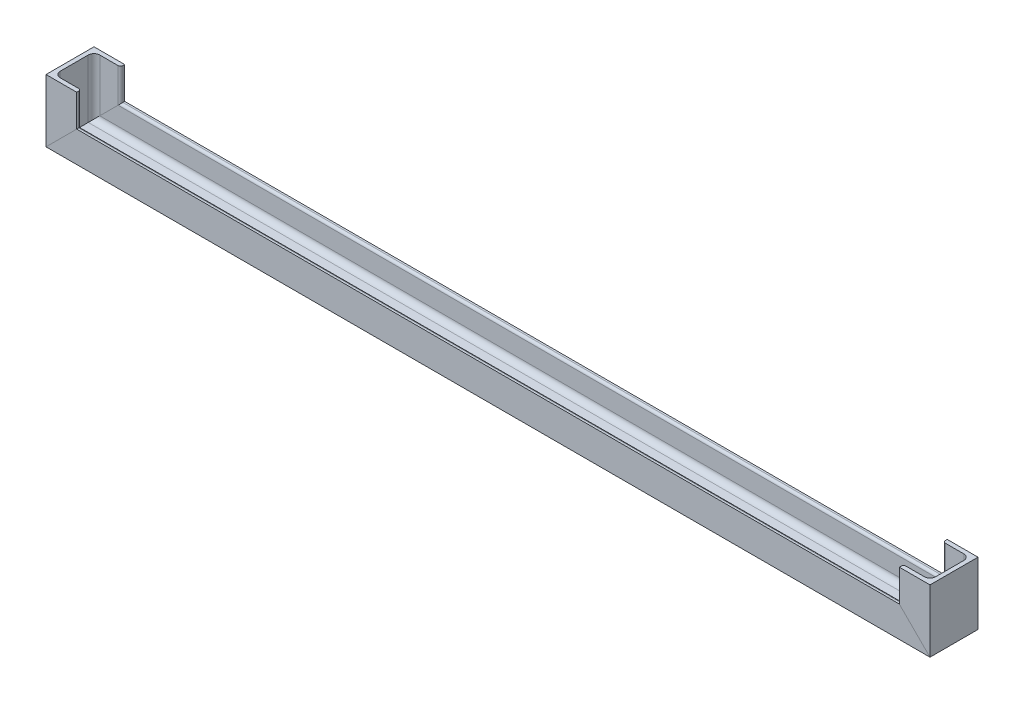
ISO-10303-21;
HEADER;
FILE_DESCRIPTION(('STEP AP214'),'2;1');
FILE_NAME('part.step','',(''),(''),'','','');
FILE_SCHEMA(('AUTOMOTIVE_DESIGN { 1 0 10303 214 1 1 1 1 }'));
ENDSEC;
DATA;
#1=APPLICATION_CONTEXT('core data for automotive mechanical design processes');
#2=APPLICATION_PROTOCOL_DEFINITION('international standard','automotive_design',2000,#1);
#3=PRODUCT_CONTEXT('',#1,'mechanical');
#4=PRODUCT('Part','Part','',(#3));
#5=PRODUCT_RELATED_PRODUCT_CATEGORY('part','',(#4));
#6=PRODUCT_DEFINITION_FORMATION('','',#4);
#7=PRODUCT_DEFINITION_CONTEXT('part definition',#1,'design');
#8=PRODUCT_DEFINITION('design','',#6,#7);
#9=PRODUCT_DEFINITION_SHAPE('','',#8);
#10=(LENGTH_UNIT() NAMED_UNIT(*) SI_UNIT(.MILLI.,.METRE.));
#11=(NAMED_UNIT(*) PLANE_ANGLE_UNIT() SI_UNIT($,.RADIAN.));
#12=(NAMED_UNIT(*) SI_UNIT($,.STERADIAN.) SOLID_ANGLE_UNIT());
#13=UNCERTAINTY_MEASURE_WITH_UNIT(LENGTH_MEASURE(1.E-05),#10,'distance_accuracy_value','');
#14=(GEOMETRIC_REPRESENTATION_CONTEXT(3) GLOBAL_UNCERTAINTY_ASSIGNED_CONTEXT((#13)) GLOBAL_UNIT_ASSIGNED_CONTEXT((#10,
#11,#12)) REPRESENTATION_CONTEXT('',''));
#15=CARTESIAN_POINT('',(0.,0.,0.));
#16=DIRECTION('',(0.,0.,1.));
#17=DIRECTION('',(1.,0.,0.));
#18=AXIS2_PLACEMENT_3D('',#15,#16,#17);
#19=CARTESIAN_POINT('',(-430.900000000001,69.2500000000001,23.1));
#20=DIRECTION('',(0.,1.,0.));
#21=DIRECTION('',(0.,0.,1.));
#22=AXIS2_PLACEMENT_3D('',#19,#20,#21);
#23=PLANE('',#22);
#24=DIRECTION('',(-1.,0.,0.));
#25=VECTOR('',#24,1.);
#26=CARTESIAN_POINT('',(-460.400000000001,69.2500000000001,25.));
#27=LINE('',#26,#25);
#28=CARTESIAN_POINT('',(-428.400000000001,69.2500000000001,25.));
#29=VERTEX_POINT('',#28);
#30=CARTESIAN_POINT('',(-460.400000000001,69.2500000000001,25.));
#31=VERTEX_POINT('',#30);
#32=EDGE_CURVE('E297',#29,#31,#27,.T.);
#33=ORIENTED_EDGE('',*,*,#32,.F.);
#34=DIRECTION('',(0.,0.,1.));
#35=VECTOR('',#34,1.);
#36=CARTESIAN_POINT('',(-428.400000000001,69.2500000000001,25.));
#37=LINE('',#36,#35);
#38=CARTESIAN_POINT('',(-428.400000000001,69.2500000000001,23.1));
#39=VERTEX_POINT('',#38);
#40=EDGE_CURVE('E304',#39,#29,#37,.T.);
#41=ORIENTED_EDGE('',*,*,#40,.F.);
#42=CARTESIAN_POINT('',(-430.900000000001,69.2500000000001,23.1));
#43=DIRECTION('',(0.,-1.,0.));
#44=DIRECTION('',(0.,0.,1.));
#45=AXIS2_PLACEMENT_3D('',#42,#43,#44);
#46=CIRCLE('',#45,2.5);
#47=CARTESIAN_POINT('',(-430.900000000001,69.2500000000001,20.6));
#48=VERTEX_POINT('',#47);
#49=EDGE_CURVE('E307',#48,#39,#46,.T.);
#50=ORIENTED_EDGE('',*,*,#49,.F.);
#51=DIRECTION('',(1.,0.,0.));
#52=VECTOR('',#51,1.);
#53=CARTESIAN_POINT('',(-430.900000000001,69.2500000000001,20.6));
#54=LINE('',#53,#52);
#55=CARTESIAN_POINT('',(-450.000000000001,69.2500000000001,20.6));
#56=VERTEX_POINT('',#55);
#57=EDGE_CURVE('E310',#56,#48,#54,.T.);
#58=ORIENTED_EDGE('',*,*,#57,.F.);
#59=CARTESIAN_POINT('',(-450.000000000001,69.2500000000001,14.6));
#60=DIRECTION('',(0.,1.,0.));
#61=DIRECTION('',(0.,0.,-1.));
#62=AXIS2_PLACEMENT_3D('',#59,#60,#61);
#63=CIRCLE('',#62,6.);
#64=CARTESIAN_POINT('',(-456.000000000001,69.2500000000001,14.6));
#65=VERTEX_POINT('',#64);
#66=EDGE_CURVE('E313',#65,#56,#63,.T.);
#67=ORIENTED_EDGE('',*,*,#66,.F.);
#68=DIRECTION('',(0.,0.,1.));
#69=VECTOR('',#68,1.);
#70=CARTESIAN_POINT('',(-456.000000000001,69.2500000000001,14.6));
#71=LINE('',#70,#69);
#72=CARTESIAN_POINT('',(-456.000000000001,69.2500000000001,-14.6));
#73=VERTEX_POINT('',#72);
#74=EDGE_CURVE('E316',#73,#65,#71,.T.);
#75=ORIENTED_EDGE('',*,*,#74,.F.);
#76=CARTESIAN_POINT('',(-450.000000000001,69.2500000000001,-14.6));
#77=DIRECTION('',(0.,1.,0.));
#78=DIRECTION('',(0.,0.,1.));
#79=AXIS2_PLACEMENT_3D('',#76,#77,#78);
#80=CIRCLE('',#79,6.);
#81=CARTESIAN_POINT('',(-450.000000000001,69.2500000000001,-20.6));
#82=VERTEX_POINT('',#81);
#83=EDGE_CURVE('E319',#82,#73,#80,.T.);
#84=ORIENTED_EDGE('',*,*,#83,.F.);
#85=DIRECTION('',(-1.,0.,0.));
#86=VECTOR('',#85,1.);
#87=CARTESIAN_POINT('',(-430.900000000001,69.2500000000001,-20.6));
#88=LINE('',#87,#86);
#89=CARTESIAN_POINT('',(-430.900000000001,69.2500000000001,-20.6));
#90=VERTEX_POINT('',#89);
#91=EDGE_CURVE('E322',#90,#82,#88,.T.);
#92=ORIENTED_EDGE('',*,*,#91,.F.);
#93=CARTESIAN_POINT('',(-430.900000000001,69.2500000000001,-23.1));
#94=DIRECTION('',(0.,-1.,0.));
#95=DIRECTION('',(0.,0.,-1.));
#96=AXIS2_PLACEMENT_3D('',#93,#94,#95);
#97=CIRCLE('',#96,2.5);
#98=CARTESIAN_POINT('',(-428.400000000001,69.2500000000001,-23.1));
#99=VERTEX_POINT('',#98);
#100=EDGE_CURVE('E325',#99,#90,#97,.T.);
#101=ORIENTED_EDGE('',*,*,#100,.F.);
#102=DIRECTION('',(0.,0.,1.));
#103=VECTOR('',#102,1.);
#104=CARTESIAN_POINT('',(-428.400000000001,69.2500000000001,-25.));
#105=LINE('',#104,#103);
#106=CARTESIAN_POINT('',(-428.400000000001,69.2500000000001,-25.));
#107=VERTEX_POINT('',#106);
#108=EDGE_CURVE('E44',#107,#99,#105,.T.);
#109=ORIENTED_EDGE('',*,*,#108,.F.);
#110=DIRECTION('',(1.,0.,0.));
#111=VECTOR('',#110,1.);
#112=CARTESIAN_POINT('',(-460.400000000001,69.2500000000001,-25.));
#113=LINE('',#112,#111);
#114=CARTESIAN_POINT('',(-460.400000000001,69.2500000000001,-25.));
#115=VERTEX_POINT('',#114);
#116=EDGE_CURVE('E11',#115,#107,#113,.T.);
#117=ORIENTED_EDGE('',*,*,#116,.F.);
#118=DIRECTION('',(0.,0.,-1.));
#119=VECTOR('',#118,1.);
#120=CARTESIAN_POINT('',(-460.400000000001,69.2500000000001,-25.));
#121=LINE('',#120,#119);
#122=EDGE_CURVE('E295',#31,#115,#121,.T.);
#123=ORIENTED_EDGE('',*,*,#122,.F.);
#124=EDGE_LOOP('',(#33,#41,#50,#58,#67,#75,#84,#92,#101,#109,#117,#123));
#125=FACE_BOUND('',#124,.T.);
#126=ADVANCED_FACE('F36',(#125),#23,.T.);
#127=CARTESIAN_POINT('',(-460.400000000001,3.99999999999989,-25.));
#128=DIRECTION('',(0.,0.,-1.));
#129=DIRECTION('',(-1.,0.,0.));
#130=AXIS2_PLACEMENT_3D('',#127,#128,#129);
#131=PLANE('',#130);
#132=DIRECTION('',(-0.707106781186548,-0.707106781186548,0.));
#133=VECTOR('',#132,1.);
#134=CARTESIAN_POINT('',(-427.775000000001,36.625,-25.));
#135=LINE('',#134,#133);
#136=CARTESIAN_POINT('',(-428.400000000001,35.9999999999999,-25.));
#137=VERTEX_POINT('',#136);
#138=CARTESIAN_POINT('',(-460.400000000001,3.99999999999995,-25.));
#139=VERTEX_POINT('',#138);
#140=EDGE_CURVE('E294',#137,#139,#135,.T.);
#141=ORIENTED_EDGE('',*,*,#140,.F.);
#142=DIRECTION('',(1.,0.,0.));
#143=VECTOR('',#142,1.);
#144=CARTESIAN_POINT('',(-460.400000000001,35.9999999999999,-25.));
#145=LINE('',#144,#143);
#146=CARTESIAN_POINT('',(428.400000000001,35.9999999999999,-25.));
#147=VERTEX_POINT('',#146);
#148=EDGE_CURVE('E39',#137,#147,#145,.T.);
#149=ORIENTED_EDGE('',*,*,#148,.T.);
#150=DIRECTION('',(0.707106781186547,-0.707106781186548,0.));
#151=VECTOR('',#150,1.);
#152=CARTESIAN_POINT('',(427.775000000001,36.6249999999999,-25.));
#153=LINE('',#152,#151);
#154=CARTESIAN_POINT('',(460.400000000001,3.99999999999988,-25.));
#155=VERTEX_POINT('',#154);
#156=EDGE_CURVE('E226',#147,#155,#153,.T.);
#157=ORIENTED_EDGE('',*,*,#156,.T.);
#158=DIRECTION('',(1.,0.,0.));
#159=VECTOR('',#158,1.);
#160=CARTESIAN_POINT('',(-460.400000000001,3.99999999999989,-25.));
#161=LINE('',#160,#159);
#162=EDGE_CURVE('E224',#139,#155,#161,.T.);
#163=ORIENTED_EDGE('',*,*,#162,.F.);
#164=EDGE_LOOP('',(#141,#149,#157,#163));
#165=FACE_BOUND('',#164,.T.);
#166=ADVANCED_FACE('F410',(#165),#131,.T.);
#167=CARTESIAN_POINT('',(-460.400000000001,35.9999999999999,-25.));
#168=DIRECTION('',(0.,1.,0.));
#169=DIRECTION('',(-1.,0.,0.));
#170=AXIS2_PLACEMENT_3D('',#167,#168,#169);
#171=PLANE('',#170);
#172=DIRECTION('',(0.,0.,-1.));
#173=VECTOR('',#172,1.);
#174=CARTESIAN_POINT('',(-428.400000000001,35.9999999999999,-25.));
#175=LINE('',#174,#173);
#176=CARTESIAN_POINT('',(-428.400000000001,35.9999999999999,-23.1));
#177=VERTEX_POINT('',#176);
#178=EDGE_CURVE('E357',#177,#137,#175,.T.);
#179=ORIENTED_EDGE('',*,*,#178,.F.);
#180=DIRECTION('',(1.,0.,0.));
#181=VECTOR('',#180,1.);
#182=CARTESIAN_POINT('',(-460.400000000001,35.9999999999999,-23.1));
#183=LINE('',#182,#181);
#184=CARTESIAN_POINT('',(428.400000000001,35.9999999999999,-23.1));
#185=VERTEX_POINT('',#184);
#186=EDGE_CURVE('E405',#177,#185,#183,.T.);
#187=ORIENTED_EDGE('',*,*,#186,.T.);
#188=DIRECTION('',(0.,0.,-1.));
#189=VECTOR('',#188,1.);
#190=CARTESIAN_POINT('',(428.400000000001,35.9999999999999,-25.));
#191=LINE('',#190,#189);
#192=EDGE_CURVE('E258',#185,#147,#191,.T.);
#193=ORIENTED_EDGE('',*,*,#192,.T.);
#194=ORIENTED_EDGE('',*,*,#148,.F.);
#195=EDGE_LOOP('',(#179,#187,#193,#194));
#196=FACE_BOUND('',#195,.T.);
#197=ADVANCED_FACE('F421',(#196),#171,.T.);
#198=CARTESIAN_POINT('',(-460.400000000001,33.4999999999999,-23.1));
#199=DIRECTION('',(1.,0.,0.));
#200=DIRECTION('',(0.,1.,0.));
#201=AXIS2_PLACEMENT_3D('',#198,#199,#200);
#202=CYLINDRICAL_SURFACE('',#201,2.5);
#203=CARTESIAN_POINT('',(-430.900000000001,33.4999999999999,-23.1));
#204=DIRECTION('',(0.707106781186547,-0.707106781186547,0.));
#205=DIRECTION('',(-0.707106781186548,-0.707106781186548,0.));
#206=AXIS2_PLACEMENT_3D('',#203,#204,#205);
#207=ELLIPSE('',#206,3.53553390593274,2.5);
#208=CARTESIAN_POINT('',(-430.900000000001,33.4999999999999,-20.6));
#209=VERTEX_POINT('',#208);
#210=EDGE_CURVE('E354',#209,#177,#207,.F.);
#211=ORIENTED_EDGE('',*,*,#210,.F.);
#212=DIRECTION('',(1.,0.,0.));
#213=VECTOR('',#212,1.);
#214=CARTESIAN_POINT('',(-460.400000000001,33.4999999999999,-20.6));
#215=LINE('',#214,#213);
#216=CARTESIAN_POINT('',(430.900000000001,33.4999999999998,-20.6));
#217=VERTEX_POINT('',#216);
#218=EDGE_CURVE('E404',#209,#217,#215,.T.);
#219=ORIENTED_EDGE('',*,*,#218,.T.);
#220=CARTESIAN_POINT('',(430.900000000001,33.4999999999999,-23.1));
#221=DIRECTION('',(0.707106781186548,0.707106781186547,0.));
#222=DIRECTION('',(0.707106781186547,-0.707106781186548,0.));
#223=AXIS2_PLACEMENT_3D('',#220,#221,#222);
#224=ELLIPSE('',#223,3.53553390593274,2.5);
#225=EDGE_CURVE('E255',#217,#185,#224,.F.);
#226=ORIENTED_EDGE('',*,*,#225,.T.);
#227=ORIENTED_EDGE('',*,*,#186,.F.);
#228=EDGE_LOOP('',(#211,#219,#226,#227));
#229=FACE_BOUND('',#228,.T.);
#230=ADVANCED_FACE('F506',(#229),#202,.T.);
#231=CARTESIAN_POINT('',(-460.400000000001,33.4999999999999,-20.6));
#232=DIRECTION('',(0.,0.,1.));
#233=DIRECTION('',(0.,-1.,0.));
#234=AXIS2_PLACEMENT_3D('',#231,#232,#233);
#235=PLANE('',#234);
#236=DIRECTION('',(0.707106781186548,0.707106781186548,0.));
#237=VECTOR('',#236,1.);
#238=CARTESIAN_POINT('',(-413.025000000001,51.375,-20.6));
#239=LINE('',#238,#237);
#240=CARTESIAN_POINT('',(-450.000000000001,14.4,-20.6));
#241=VERTEX_POINT('',#240);
#242=EDGE_CURVE('E351',#241,#209,#239,.T.);
#243=ORIENTED_EDGE('',*,*,#242,.F.);
#244=DIRECTION('',(1.,0.,0.));
#245=VECTOR('',#244,1.);
#246=CARTESIAN_POINT('',(-460.400000000001,14.4,-20.6));
#247=LINE('',#246,#245);
#248=CARTESIAN_POINT('',(450.000000000001,14.3999999999999,-20.6));
#249=VERTEX_POINT('',#248);
#250=EDGE_CURVE('E402',#241,#249,#247,.T.);
#251=ORIENTED_EDGE('',*,*,#250,.T.);
#252=DIRECTION('',(-0.707106781186547,0.707106781186548,0.));
#253=VECTOR('',#252,1.);
#254=CARTESIAN_POINT('',(413.025000000001,51.3749999999999,-20.6));
#255=LINE('',#254,#253);
#256=EDGE_CURVE('E252',#249,#217,#255,.T.);
#257=ORIENTED_EDGE('',*,*,#256,.T.);
#258=ORIENTED_EDGE('',*,*,#218,.F.);
#259=EDGE_LOOP('',(#243,#251,#257,#258));
#260=FACE_BOUND('',#259,.T.);
#261=ADVANCED_FACE('F501',(#260),#235,.T.);
#262=CARTESIAN_POINT('',(-460.400000000001,14.3999999999999,-14.6));
#263=DIRECTION('',(1.,0.,0.));
#264=DIRECTION('',(0.,1.,0.));
#265=AXIS2_PLACEMENT_3D('',#262,#263,#264);
#266=CYLINDRICAL_SURFACE('',#265,6.);
#267=CARTESIAN_POINT('',(-450.000000000001,14.3999999999999,-14.6));
#268=DIRECTION('',(0.707106781186547,-0.707106781186547,0.));
#269=DIRECTION('',(-0.707106781186548,-0.707106781186548,0.));
#270=AXIS2_PLACEMENT_3D('',#267,#268,#269);
#271=ELLIPSE('',#270,8.48528137423857,6.);
#272=CARTESIAN_POINT('',(-456.000000000001,8.3999999999999,-14.6));
#273=VERTEX_POINT('',#272);
#274=EDGE_CURVE('E348',#273,#241,#271,.T.);
#275=ORIENTED_EDGE('',*,*,#274,.F.);
#276=DIRECTION('',(1.,0.,0.));
#277=VECTOR('',#276,1.);
#278=CARTESIAN_POINT('',(-460.400000000001,8.39999999999991,-14.6));
#279=LINE('',#278,#277);
#280=CARTESIAN_POINT('',(456.000000000001,8.39999999999984,-14.6));
#281=VERTEX_POINT('',#280);
#282=EDGE_CURVE('E400',#273,#281,#279,.T.);
#283=ORIENTED_EDGE('',*,*,#282,.T.);
#284=CARTESIAN_POINT('',(450.000000000001,14.3999999999998,-14.6));
#285=DIRECTION('',(0.707106781186548,0.707106781186547,0.));
#286=DIRECTION('',(0.707106781186547,-0.707106781186548,0.));
#287=AXIS2_PLACEMENT_3D('',#284,#285,#286);
#288=ELLIPSE('',#287,8.48528137423857,6.);
#289=EDGE_CURVE('E249',#281,#249,#288,.T.);
#290=ORIENTED_EDGE('',*,*,#289,.T.);
#291=ORIENTED_EDGE('',*,*,#250,.F.);
#292=EDGE_LOOP('',(#275,#283,#290,#291));
#293=FACE_BOUND('',#292,.T.);
#294=ADVANCED_FACE('F494',(#293),#266,.F.);
#295=CARTESIAN_POINT('',(-460.400000000001,8.39999999999991,14.6));
#296=DIRECTION('',(0.,1.,0.));
#297=DIRECTION('',(-1.,0.,0.));
#298=AXIS2_PLACEMENT_3D('',#295,#296,#297);
#299=PLANE('',#298);
#300=DIRECTION('',(0.,0.,-1.));
#301=VECTOR('',#300,1.);
#302=CARTESIAN_POINT('',(-456.000000000001,8.39999999999991,14.6));
#303=LINE('',#302,#301);
#304=CARTESIAN_POINT('',(-456.000000000001,8.39999999999991,14.6));
#305=VERTEX_POINT('',#304);
#306=EDGE_CURVE('E345',#305,#273,#303,.T.);
#307=ORIENTED_EDGE('',*,*,#306,.F.);
#308=DIRECTION('',(1.,0.,0.));
#309=VECTOR('',#308,1.);
#310=CARTESIAN_POINT('',(-460.400000000001,8.39999999999991,14.6));
#311=LINE('',#310,#309);
#312=CARTESIAN_POINT('',(456.000000000001,8.39999999999985,14.6));
#313=VERTEX_POINT('',#312);
#314=EDGE_CURVE('E398',#305,#313,#311,.T.);
#315=ORIENTED_EDGE('',*,*,#314,.T.);
#316=DIRECTION('',(0.,0.,-1.));
#317=VECTOR('',#316,1.);
#318=CARTESIAN_POINT('',(456.000000000001,8.39999999999985,14.6));
#319=LINE('',#318,#317);
#320=EDGE_CURVE('E246',#313,#281,#319,.T.);
#321=ORIENTED_EDGE('',*,*,#320,.T.);
#322=ORIENTED_EDGE('',*,*,#282,.F.);
#323=EDGE_LOOP('',(#307,#315,#321,#322));
#324=FACE_BOUND('',#323,.T.);
#325=ADVANCED_FACE('F487',(#324),#299,.T.);
#326=CARTESIAN_POINT('',(-460.400000000001,14.3999999999999,14.6));
#327=DIRECTION('',(1.,0.,0.));
#328=DIRECTION('',(0.,1.,0.));
#329=AXIS2_PLACEMENT_3D('',#326,#327,#328);
#330=CYLINDRICAL_SURFACE('',#329,6.);
#331=CARTESIAN_POINT('',(-450.000000000001,14.3999999999999,14.6));
#332=DIRECTION('',(0.707106781186547,-0.707106781186547,0.));
#333=DIRECTION('',(-0.707106781186548,-0.707106781186548,0.));
#334=AXIS2_PLACEMENT_3D('',#331,#332,#333);
#335=ELLIPSE('',#334,8.48528137423857,6.);
#336=CARTESIAN_POINT('',(-450.000000000001,14.4,20.6));
#337=VERTEX_POINT('',#336);
#338=EDGE_CURVE('E342',#337,#305,#335,.T.);
#339=ORIENTED_EDGE('',*,*,#338,.F.);
#340=DIRECTION('',(1.,0.,0.));
#341=VECTOR('',#340,1.);
#342=CARTESIAN_POINT('',(-460.400000000001,14.4,20.6));
#343=LINE('',#342,#341);
#344=CARTESIAN_POINT('',(450.000000000001,14.3999999999999,20.6));
#345=VERTEX_POINT('',#344);
#346=EDGE_CURVE('E396',#337,#345,#343,.T.);
#347=ORIENTED_EDGE('',*,*,#346,.T.);
#348=CARTESIAN_POINT('',(450.000000000001,14.3999999999998,14.6));
#349=DIRECTION('',(0.707106781186548,0.707106781186547,0.));
#350=DIRECTION('',(0.707106781186547,-0.707106781186548,0.));
#351=AXIS2_PLACEMENT_3D('',#348,#349,#350);
#352=ELLIPSE('',#351,8.48528137423857,6.);
#353=EDGE_CURVE('E243',#345,#313,#352,.T.);
#354=ORIENTED_EDGE('',*,*,#353,.T.);
#355=ORIENTED_EDGE('',*,*,#314,.F.);
#356=EDGE_LOOP('',(#339,#347,#354,#355));
#357=FACE_BOUND('',#356,.T.);
#358=ADVANCED_FACE('F480',(#357),#330,.F.);
#359=CARTESIAN_POINT('',(-460.400000000001,33.4999999999999,20.6));
#360=DIRECTION('',(0.,0.,-1.));
#361=DIRECTION('',(0.,1.,0.));
#362=AXIS2_PLACEMENT_3D('',#359,#360,#361);
#363=PLANE('',#362);
#364=DIRECTION('',(-0.707106781186548,-0.707106781186548,0.));
#365=VECTOR('',#364,1.);
#366=CARTESIAN_POINT('',(-413.025000000001,51.375,20.6));
#367=LINE('',#366,#365);
#368=CARTESIAN_POINT('',(-430.900000000001,33.4999999999999,20.6));
#369=VERTEX_POINT('',#368);
#370=EDGE_CURVE('E339',#369,#337,#367,.T.);
#371=ORIENTED_EDGE('',*,*,#370,.F.);
#372=DIRECTION('',(1.,0.,0.));
#373=VECTOR('',#372,1.);
#374=CARTESIAN_POINT('',(-460.400000000001,33.4999999999999,20.6));
#375=LINE('',#374,#373);
#376=CARTESIAN_POINT('',(430.900000000001,33.4999999999998,20.6));
#377=VERTEX_POINT('',#376);
#378=EDGE_CURVE('E394',#369,#377,#375,.T.);
#379=ORIENTED_EDGE('',*,*,#378,.T.);
#380=DIRECTION('',(0.707106781186547,-0.707106781186548,0.));
#381=VECTOR('',#380,1.);
#382=CARTESIAN_POINT('',(413.025000000001,51.3749999999999,20.6));
#383=LINE('',#382,#381);
#384=EDGE_CURVE('E240',#377,#345,#383,.T.);
#385=ORIENTED_EDGE('',*,*,#384,.T.);
#386=ORIENTED_EDGE('',*,*,#346,.F.);
#387=EDGE_LOOP('',(#371,#379,#385,#386));
#388=FACE_BOUND('',#387,.T.);
#389=ADVANCED_FACE('F473',(#388),#363,.T.);
#390=CARTESIAN_POINT('',(-460.400000000001,33.4999999999999,23.1));
#391=DIRECTION('',(1.,0.,0.));
#392=DIRECTION('',(0.,1.,0.));
#393=AXIS2_PLACEMENT_3D('',#390,#391,#392);
#394=CYLINDRICAL_SURFACE('',#393,2.5);
#395=CARTESIAN_POINT('',(-430.900000000001,33.4999999999999,23.1));
#396=DIRECTION('',(0.707106781186547,-0.707106781186547,0.));
#397=DIRECTION('',(-0.707106781186548,-0.707106781186548,0.));
#398=AXIS2_PLACEMENT_3D('',#395,#396,#397);
#399=ELLIPSE('',#398,3.53553390593274,2.5);
#400=CARTESIAN_POINT('',(-428.400000000001,35.9999999999999,23.1));
#401=VERTEX_POINT('',#400);
#402=EDGE_CURVE('E336',#401,#369,#399,.F.);
#403=ORIENTED_EDGE('',*,*,#402,.F.);
#404=DIRECTION('',(1.,0.,0.));
#405=VECTOR('',#404,1.);
#406=CARTESIAN_POINT('',(-460.400000000001,35.9999999999999,23.1));
#407=LINE('',#406,#405);
#408=CARTESIAN_POINT('',(428.400000000001,35.9999999999999,23.1));
#409=VERTEX_POINT('',#408);
#410=EDGE_CURVE('E392',#401,#409,#407,.T.);
#411=ORIENTED_EDGE('',*,*,#410,.T.);
#412=CARTESIAN_POINT('',(430.900000000001,33.4999999999999,23.1));
#413=DIRECTION('',(0.707106781186548,0.707106781186547,0.));
#414=DIRECTION('',(0.707106781186547,-0.707106781186548,0.));
#415=AXIS2_PLACEMENT_3D('',#412,#413,#414);
#416=ELLIPSE('',#415,3.53553390593274,2.5);
#417=EDGE_CURVE('E233',#409,#377,#416,.F.);
#418=ORIENTED_EDGE('',*,*,#417,.T.);
#419=ORIENTED_EDGE('',*,*,#378,.F.);
#420=EDGE_LOOP('',(#403,#411,#418,#419));
#421=FACE_BOUND('',#420,.T.);
#422=ADVANCED_FACE('F466',(#421),#394,.T.);
#423=CARTESIAN_POINT('',(-460.400000000001,35.9999999999999,25.));
#424=DIRECTION('',(0.,1.,0.));
#425=DIRECTION('',(-1.,0.,0.));
#426=AXIS2_PLACEMENT_3D('',#423,#424,#425);
#427=PLANE('',#426);
#428=DIRECTION('',(0.,0.,-1.));
#429=VECTOR('',#428,1.);
#430=CARTESIAN_POINT('',(-428.400000000001,35.9999999999999,25.));
#431=LINE('',#430,#429);
#432=CARTESIAN_POINT('',(-428.400000000001,35.9999999999999,25.));
#433=VERTEX_POINT('',#432);
#434=EDGE_CURVE('E333',#433,#401,#431,.T.);
#435=ORIENTED_EDGE('',*,*,#434,.F.);
#436=DIRECTION('',(1.,0.,0.));
#437=VECTOR('',#436,1.);
#438=CARTESIAN_POINT('',(-460.400000000001,35.9999999999999,25.));
#439=LINE('',#438,#437);
#440=CARTESIAN_POINT('',(428.400000000001,35.9999999999999,25.));
#441=VERTEX_POINT('',#440);
#442=EDGE_CURVE('E205',#433,#441,#439,.T.);
#443=ORIENTED_EDGE('',*,*,#442,.T.);
#444=DIRECTION('',(0.,0.,-1.));
#445=VECTOR('',#444,1.);
#446=CARTESIAN_POINT('',(428.400000000001,35.9999999999999,25.));
#447=LINE('',#446,#445);
#448=EDGE_CURVE('E230',#441,#409,#447,.T.);
#449=ORIENTED_EDGE('',*,*,#448,.T.);
#450=ORIENTED_EDGE('',*,*,#410,.F.);
#451=EDGE_LOOP('',(#435,#443,#449,#450));
#452=FACE_BOUND('',#451,.T.);
#453=ADVANCED_FACE('F460',(#452),#427,.T.);
#454=CARTESIAN_POINT('',(-460.400000000001,3.99999999999989,25.));
#455=DIRECTION('',(0.,0.,1.));
#456=DIRECTION('',(1.,0.,0.));
#457=AXIS2_PLACEMENT_3D('',#454,#455,#456);
#458=PLANE('',#457);
#459=DIRECTION('',(0.707106781186548,0.707106781186548,0.));
#460=VECTOR('',#459,1.);
#461=CARTESIAN_POINT('',(-427.775000000001,36.625,25.));
#462=LINE('',#461,#460);
#463=CARTESIAN_POINT('',(-460.400000000001,3.99999999999995,25.));
#464=VERTEX_POINT('',#463);
#465=EDGE_CURVE('E201',#464,#433,#462,.T.);
#466=ORIENTED_EDGE('',*,*,#465,.F.);
#467=DIRECTION('',(1.,0.,0.));
#468=VECTOR('',#467,1.);
#469=CARTESIAN_POINT('',(-460.400000000001,3.99999999999989,25.));
#470=LINE('',#469,#468);
#471=CARTESIAN_POINT('',(460.400000000001,3.99999999999988,25.));
#472=VERTEX_POINT('',#471);
#473=EDGE_CURVE('E193',#464,#472,#470,.T.);
#474=ORIENTED_EDGE('',*,*,#473,.T.);
#475=DIRECTION('',(-0.707106781186547,0.707106781186548,0.));
#476=VECTOR('',#475,1.);
#477=CARTESIAN_POINT('',(427.775000000001,36.6249999999999,25.));
#478=LINE('',#477,#476);
#479=EDGE_CURVE('E198',#472,#441,#478,.T.);
#480=ORIENTED_EDGE('',*,*,#479,.T.);
#481=ORIENTED_EDGE('',*,*,#442,.F.);
#482=EDGE_LOOP('',(#466,#474,#480,#481));
#483=FACE_BOUND('',#482,.T.);
#484=ADVANCED_FACE('F195',(#483),#458,.T.);
#485=CARTESIAN_POINT('',(-460.400000000001,3.99999999999989,-25.));
#486=DIRECTION('',(0.,-1.,0.));
#487=DIRECTION('',(1.,0.,0.));
#488=AXIS2_PLACEMENT_3D('',#485,#486,#487);
#489=PLANE('',#488);
#490=ORIENTED_EDGE('',*,*,#162,.T.);
#491=DIRECTION('',(0.,0.,-1.));
#492=VECTOR('',#491,1.);
#493=CARTESIAN_POINT('',(460.400000000001,3.99999999999994,-25.));
#494=LINE('',#493,#492);
#495=EDGE_CURVE('E213',#472,#155,#494,.T.);
#496=ORIENTED_EDGE('',*,*,#495,.F.);
#497=ORIENTED_EDGE('',*,*,#473,.F.);
#498=DIRECTION('',(0.,0.,-1.));
#499=VECTOR('',#498,1.);
#500=CARTESIAN_POINT('',(-460.400000000001,4.,-25.));
#501=LINE('',#500,#499);
#502=EDGE_CURVE('E291',#464,#139,#501,.T.);
#503=ORIENTED_EDGE('',*,*,#502,.T.);
#504=EDGE_LOOP('',(#490,#496,#497,#503));
#505=FACE_BOUND('',#504,.T.);
#506=ADVANCED_FACE('F222',(#505),#489,.T.);
#507=CARTESIAN_POINT('',(-460.400000000001,69.2500000000001,-25.));
#508=DIRECTION('',(-1.,0.,0.));
#509=DIRECTION('',(0.,0.,1.));
#510=AXIS2_PLACEMENT_3D('',#507,#508,#509);
#511=PLANE('',#510);
#512=ORIENTED_EDGE('',*,*,#502,.F.);
#513=DIRECTION('',(0.,-1.,0.));
#514=VECTOR('',#513,1.);
#515=CARTESIAN_POINT('',(-460.400000000001,69.2500000000001,25.));
#516=LINE('',#515,#514);
#517=EDGE_CURVE('E293',#31,#464,#516,.T.);
#518=ORIENTED_EDGE('',*,*,#517,.F.);
#519=ORIENTED_EDGE('',*,*,#122,.T.);
#520=DIRECTION('',(0.,-1.,0.));
#521=VECTOR('',#520,1.);
#522=CARTESIAN_POINT('',(-460.400000000001,69.2500000000001,-25.));
#523=LINE('',#522,#521);
#524=EDGE_CURVE('E298',#115,#139,#523,.T.);
#525=ORIENTED_EDGE('',*,*,#524,.T.);
#526=EDGE_LOOP('',(#512,#518,#519,#525));
#527=FACE_BOUND('',#526,.T.);
#528=ADVANCED_FACE('F518',(#527),#511,.T.);
#529=CARTESIAN_POINT('',(-460.400000000001,69.2500000000001,-25.));
#530=DIRECTION('',(0.,0.,-1.));
#531=DIRECTION('',(-1.,0.,0.));
#532=AXIS2_PLACEMENT_3D('',#529,#530,#531);
#533=PLANE('',#532);
#534=DIRECTION('',(0.,-1.,0.));
#535=VECTOR('',#534,1.);
#536=CARTESIAN_POINT('',(-428.400000000001,69.2500000000001,-25.));
#537=LINE('',#536,#535);
#538=EDGE_CURVE('E330',#107,#137,#537,.T.);
#539=ORIENTED_EDGE('',*,*,#538,.T.);
#540=ORIENTED_EDGE('',*,*,#140,.T.);
#541=ORIENTED_EDGE('',*,*,#524,.F.);
#542=ORIENTED_EDGE('',*,*,#116,.T.);
#543=EDGE_LOOP('',(#539,#540,#541,#542));
#544=FACE_BOUND('',#543,.T.);
#545=ADVANCED_FACE('F515',(#544),#533,.T.);
#546=CARTESIAN_POINT('',(-428.400000000001,69.2500000000001,-25.));
#547=DIRECTION('',(1.,0.,0.));
#548=DIRECTION('',(0.,0.,-1.));
#549=AXIS2_PLACEMENT_3D('',#546,#547,#548);
#550=PLANE('',#549);
#551=DIRECTION('',(0.,-1.,0.));
#552=VECTOR('',#551,1.);
#553=CARTESIAN_POINT('',(-428.400000000001,69.2500000000001,-23.1));
#554=LINE('',#553,#552);
#555=EDGE_CURVE('E385',#99,#177,#554,.T.);
#556=ORIENTED_EDGE('',*,*,#555,.T.);
#557=ORIENTED_EDGE('',*,*,#178,.T.);
#558=ORIENTED_EDGE('',*,*,#538,.F.);
#559=ORIENTED_EDGE('',*,*,#108,.T.);
#560=EDGE_LOOP('',(#556,#557,#558,#559));
#561=FACE_BOUND('',#560,.T.);
#562=ADVANCED_FACE('F512',(#561),#550,.T.);
#563=CARTESIAN_POINT('',(-430.900000000001,69.2500000000001,-23.1));
#564=DIRECTION('',(0.,-1.,0.));
#565=DIRECTION('',(0.,0.,-1.));
#566=AXIS2_PLACEMENT_3D('',#563,#564,#565);
#567=CYLINDRICAL_SURFACE('',#566,2.5);
#568=DIRECTION('',(0.,-1.,0.));
#569=VECTOR('',#568,1.);
#570=CARTESIAN_POINT('',(-430.900000000001,69.2500000000001,-20.6));
#571=LINE('',#570,#569);
#572=EDGE_CURVE('E382',#90,#209,#571,.T.);
#573=ORIENTED_EDGE('',*,*,#572,.T.);
#574=ORIENTED_EDGE('',*,*,#210,.T.);
#575=ORIENTED_EDGE('',*,*,#555,.F.);
#576=ORIENTED_EDGE('',*,*,#100,.T.);
#577=EDGE_LOOP('',(#573,#574,#575,#576));
#578=FACE_BOUND('',#577,.T.);
#579=ADVANCED_FACE('F509',(#578),#567,.T.);
#580=CARTESIAN_POINT('',(-430.900000000001,69.2500000000001,-20.6));
#581=DIRECTION('',(0.,0.,1.));
#582=DIRECTION('',(1.,0.,0.));
#583=AXIS2_PLACEMENT_3D('',#580,#581,#582);
#584=PLANE('',#583);
#585=DIRECTION('',(0.,-1.,0.));
#586=VECTOR('',#585,1.);
#587=CARTESIAN_POINT('',(-450.000000000001,69.2500000000001,-20.6));
#588=LINE('',#587,#586);
#589=EDGE_CURVE('E379',#82,#241,#588,.T.);
#590=ORIENTED_EDGE('',*,*,#589,.T.);
#591=ORIENTED_EDGE('',*,*,#242,.T.);
#592=ORIENTED_EDGE('',*,*,#572,.F.);
#593=ORIENTED_EDGE('',*,*,#91,.T.);
#594=EDGE_LOOP('',(#590,#591,#592,#593));
#595=FACE_BOUND('',#594,.T.);
#596=ADVANCED_FACE('F542',(#595),#584,.T.);
#597=CARTESIAN_POINT('',(-450.000000000001,69.2500000000001,-14.6));
#598=DIRECTION('',(0.,-1.,0.));
#599=DIRECTION('',(0.,0.,-1.));
#600=AXIS2_PLACEMENT_3D('',#597,#598,#599);
#601=CYLINDRICAL_SURFACE('',#600,6.);
#602=DIRECTION('',(0.,-1.,0.));
#603=VECTOR('',#602,1.);
#604=CARTESIAN_POINT('',(-456.000000000001,69.2500000000001,-14.6));
#605=LINE('',#604,#603);
#606=EDGE_CURVE('E376',#73,#273,#605,.T.);
#607=ORIENTED_EDGE('',*,*,#606,.T.);
#608=ORIENTED_EDGE('',*,*,#274,.T.);
#609=ORIENTED_EDGE('',*,*,#589,.F.);
#610=ORIENTED_EDGE('',*,*,#83,.T.);
#611=EDGE_LOOP('',(#607,#608,#609,#610));
#612=FACE_BOUND('',#611,.T.);
#613=ADVANCED_FACE('F540',(#612),#601,.F.);
#614=CARTESIAN_POINT('',(-456.000000000001,69.2500000000001,14.6));
#615=DIRECTION('',(1.,0.,0.));
#616=DIRECTION('',(0.,0.,-1.));
#617=AXIS2_PLACEMENT_3D('',#614,#615,#616);
#618=PLANE('',#617);
#619=DIRECTION('',(0.,-1.,0.));
#620=VECTOR('',#619,1.);
#621=CARTESIAN_POINT('',(-456.000000000001,69.2500000000001,14.6));
#622=LINE('',#621,#620);
#623=EDGE_CURVE('E373',#65,#305,#622,.T.);
#624=ORIENTED_EDGE('',*,*,#623,.T.);
#625=ORIENTED_EDGE('',*,*,#306,.T.);
#626=ORIENTED_EDGE('',*,*,#606,.F.);
#627=ORIENTED_EDGE('',*,*,#74,.T.);
#628=EDGE_LOOP('',(#624,#625,#626,#627));
#629=FACE_BOUND('',#628,.T.);
#630=ADVANCED_FACE('F536',(#629),#618,.T.);
#631=CARTESIAN_POINT('',(-450.000000000001,69.2500000000001,14.6));
#632=DIRECTION('',(0.,-1.,0.));
#633=DIRECTION('',(0.,0.,-1.));
#634=AXIS2_PLACEMENT_3D('',#631,#632,#633);
#635=CYLINDRICAL_SURFACE('',#634,6.);
#636=DIRECTION('',(0.,-1.,0.));
#637=VECTOR('',#636,1.);
#638=CARTESIAN_POINT('',(-450.000000000001,69.2500000000001,20.6));
#639=LINE('',#638,#637);
#640=EDGE_CURVE('E370',#56,#337,#639,.T.);
#641=ORIENTED_EDGE('',*,*,#640,.T.);
#642=ORIENTED_EDGE('',*,*,#338,.T.);
#643=ORIENTED_EDGE('',*,*,#623,.F.);
#644=ORIENTED_EDGE('',*,*,#66,.T.);
#645=EDGE_LOOP('',(#641,#642,#643,#644));
#646=FACE_BOUND('',#645,.T.);
#647=ADVANCED_FACE('F534',(#646),#635,.F.);
#648=CARTESIAN_POINT('',(-430.900000000001,69.2500000000001,20.6));
#649=DIRECTION('',(0.,0.,-1.));
#650=DIRECTION('',(-1.,0.,0.));
#651=AXIS2_PLACEMENT_3D('',#648,#649,#650);
#652=PLANE('',#651);
#653=DIRECTION('',(0.,-1.,0.));
#654=VECTOR('',#653,1.);
#655=CARTESIAN_POINT('',(-430.900000000001,69.2500000000001,20.6));
#656=LINE('',#655,#654);
#657=EDGE_CURVE('E367',#48,#369,#656,.T.);
#658=ORIENTED_EDGE('',*,*,#657,.T.);
#659=ORIENTED_EDGE('',*,*,#370,.T.);
#660=ORIENTED_EDGE('',*,*,#640,.F.);
#661=ORIENTED_EDGE('',*,*,#57,.T.);
#662=EDGE_LOOP('',(#658,#659,#660,#661));
#663=FACE_BOUND('',#662,.T.);
#664=ADVANCED_FACE('F530',(#663),#652,.T.);
#665=CARTESIAN_POINT('',(-430.900000000001,69.2500000000001,23.1));
#666=DIRECTION('',(0.,-1.,0.));
#667=DIRECTION('',(0.,0.,-1.));
#668=AXIS2_PLACEMENT_3D('',#665,#666,#667);
#669=CYLINDRICAL_SURFACE('',#668,2.5);
#670=DIRECTION('',(0.,-1.,0.));
#671=VECTOR('',#670,1.);
#672=CARTESIAN_POINT('',(-428.400000000001,69.2500000000001,23.1));
#673=LINE('',#672,#671);
#674=EDGE_CURVE('E364',#39,#401,#673,.T.);
#675=ORIENTED_EDGE('',*,*,#674,.T.);
#676=ORIENTED_EDGE('',*,*,#402,.T.);
#677=ORIENTED_EDGE('',*,*,#657,.F.);
#678=ORIENTED_EDGE('',*,*,#49,.T.);
#679=EDGE_LOOP('',(#675,#676,#677,#678));
#680=FACE_BOUND('',#679,.T.);
#681=ADVANCED_FACE('F528',(#680),#669,.T.);
#682=CARTESIAN_POINT('',(-428.400000000001,69.2500000000001,25.));
#683=DIRECTION('',(1.,0.,0.));
#684=DIRECTION('',(0.,0.,-1.));
#685=AXIS2_PLACEMENT_3D('',#682,#683,#684);
#686=PLANE('',#685);
#687=DIRECTION('',(0.,-1.,0.));
#688=VECTOR('',#687,1.);
#689=CARTESIAN_POINT('',(-428.400000000001,69.2500000000001,25.));
#690=LINE('',#689,#688);
#691=EDGE_CURVE('E301',#29,#433,#690,.T.);
#692=ORIENTED_EDGE('',*,*,#691,.T.);
#693=ORIENTED_EDGE('',*,*,#434,.T.);
#694=ORIENTED_EDGE('',*,*,#674,.F.);
#695=ORIENTED_EDGE('',*,*,#40,.T.);
#696=EDGE_LOOP('',(#692,#693,#694,#695));
#697=FACE_BOUND('',#696,.T.);
#698=ADVANCED_FACE('F524',(#697),#686,.T.);
#699=CARTESIAN_POINT('',(-460.400000000001,69.2500000000001,25.));
#700=DIRECTION('',(0.,0.,1.));
#701=DIRECTION('',(1.,0.,0.));
#702=AXIS2_PLACEMENT_3D('',#699,#700,#701);
#703=PLANE('',#702);
#704=ORIENTED_EDGE('',*,*,#517,.T.);
#705=ORIENTED_EDGE('',*,*,#465,.T.);
#706=ORIENTED_EDGE('',*,*,#691,.F.);
#707=ORIENTED_EDGE('',*,*,#32,.T.);
#708=EDGE_LOOP('',(#704,#705,#706,#707));
#709=FACE_BOUND('',#708,.T.);
#710=ADVANCED_FACE('F522',(#709),#703,.T.);
#711=CARTESIAN_POINT('',(430.900000000001,69.25,23.1));
#712=DIRECTION('',(0.,1.,0.));
#713=DIRECTION('',(0.,0.,1.));
#714=AXIS2_PLACEMENT_3D('',#711,#712,#713);
#715=PLANE('',#714);
#716=DIRECTION('',(1.,0.,0.));
#717=VECTOR('',#716,1.);
#718=CARTESIAN_POINT('',(460.400000000001,69.25,25.));
#719=LINE('',#718,#717);
#720=CARTESIAN_POINT('',(428.400000000001,69.25,25.));
#721=VERTEX_POINT('',#720);
#722=CARTESIAN_POINT('',(460.400000000001,69.25,25.));
#723=VERTEX_POINT('',#722);
#724=EDGE_CURVE('E423',#721,#723,#719,.T.);
#725=ORIENTED_EDGE('',*,*,#724,.T.);
#726=DIRECTION('',(0.,0.,-1.));
#727=VECTOR('',#726,1.);
#728=CARTESIAN_POINT('',(460.400000000001,69.25,-25.));
#729=LINE('',#728,#727);
#730=CARTESIAN_POINT('',(460.400000000001,69.25,-25.));
#731=VERTEX_POINT('',#730);
#732=EDGE_CURVE('E216',#723,#731,#729,.T.);
#733=ORIENTED_EDGE('',*,*,#732,.T.);
#734=DIRECTION('',(-1.,0.,0.));
#735=VECTOR('',#734,1.);
#736=CARTESIAN_POINT('',(460.400000000001,69.25,-25.));
#737=LINE('',#736,#735);
#738=CARTESIAN_POINT('',(428.400000000001,69.25,-25.));
#739=VERTEX_POINT('',#738);
#740=EDGE_CURVE('E206',#731,#739,#737,.T.);
#741=ORIENTED_EDGE('',*,*,#740,.T.);
#742=DIRECTION('',(0.,0.,1.));
#743=VECTOR('',#742,1.);
#744=CARTESIAN_POINT('',(428.400000000001,69.25,-25.));
#745=LINE('',#744,#743);
#746=CARTESIAN_POINT('',(428.400000000001,69.25,-23.1));
#747=VERTEX_POINT('',#746);
#748=EDGE_CURVE('E417',#739,#747,#745,.T.);
#749=ORIENTED_EDGE('',*,*,#748,.T.);
#750=CARTESIAN_POINT('',(430.900000000001,69.25,-23.1));
#751=DIRECTION('',(0.,1.,0.));
#752=DIRECTION('',(0.,0.,-1.));
#753=AXIS2_PLACEMENT_3D('',#750,#751,#752);
#754=CIRCLE('',#753,2.5);
#755=CARTESIAN_POINT('',(430.900000000001,69.25,-20.6));
#756=VERTEX_POINT('',#755);
#757=EDGE_CURVE('E427',#747,#756,#754,.T.);
#758=ORIENTED_EDGE('',*,*,#757,.T.);
#759=DIRECTION('',(1.,0.,0.));
#760=VECTOR('',#759,1.);
#761=CARTESIAN_POINT('',(430.900000000001,69.25,-20.6));
#762=LINE('',#761,#760);
#763=CARTESIAN_POINT('',(450.000000000001,69.25,-20.6));
#764=VERTEX_POINT('',#763);
#765=EDGE_CURVE('E430',#756,#764,#762,.T.);
#766=ORIENTED_EDGE('',*,*,#765,.T.);
#767=CARTESIAN_POINT('',(450.000000000001,69.25,-14.6));
#768=DIRECTION('',(0.,-1.,0.));
#769=DIRECTION('',(0.,0.,1.));
#770=AXIS2_PLACEMENT_3D('',#767,#768,#769);
#771=CIRCLE('',#770,6.);
#772=CARTESIAN_POINT('',(456.000000000001,69.25,-14.6));
#773=VERTEX_POINT('',#772);
#774=EDGE_CURVE('E433',#764,#773,#771,.T.);
#775=ORIENTED_EDGE('',*,*,#774,.T.);
#776=DIRECTION('',(0.,0.,1.));
#777=VECTOR('',#776,1.);
#778=CARTESIAN_POINT('',(456.000000000001,69.25,14.6));
#779=LINE('',#778,#777);
#780=CARTESIAN_POINT('',(456.000000000001,69.25,14.6));
#781=VERTEX_POINT('',#780);
#782=EDGE_CURVE('E436',#773,#781,#779,.T.);
#783=ORIENTED_EDGE('',*,*,#782,.T.);
#784=CARTESIAN_POINT('',(450.000000000001,69.25,14.6));
#785=DIRECTION('',(0.,-1.,0.));
#786=DIRECTION('',(0.,0.,-1.));
#787=AXIS2_PLACEMENT_3D('',#784,#785,#786);
#788=CIRCLE('',#787,6.);
#789=CARTESIAN_POINT('',(450.000000000001,69.25,20.6));
#790=VERTEX_POINT('',#789);
#791=EDGE_CURVE('E439',#781,#790,#788,.T.);
#792=ORIENTED_EDGE('',*,*,#791,.T.);
#793=DIRECTION('',(-1.,0.,0.));
#794=VECTOR('',#793,1.);
#795=CARTESIAN_POINT('',(430.900000000001,69.25,20.6));
#796=LINE('',#795,#794);
#797=CARTESIAN_POINT('',(430.900000000001,69.25,20.6));
#798=VERTEX_POINT('',#797);
#799=EDGE_CURVE('E442',#790,#798,#796,.T.);
#800=ORIENTED_EDGE('',*,*,#799,.T.);
#801=CARTESIAN_POINT('',(430.900000000001,69.25,23.1));
#802=DIRECTION('',(0.,1.,0.));
#803=DIRECTION('',(0.,0.,1.));
#804=AXIS2_PLACEMENT_3D('',#801,#802,#803);
#805=CIRCLE('',#804,2.5);
#806=CARTESIAN_POINT('',(428.400000000001,69.25,23.1));
#807=VERTEX_POINT('',#806);
#808=EDGE_CURVE('E445',#798,#807,#805,.T.);
#809=ORIENTED_EDGE('',*,*,#808,.T.);
#810=DIRECTION('',(0.,0.,1.));
#811=VECTOR('',#810,1.);
#812=CARTESIAN_POINT('',(428.400000000001,69.25,25.));
#813=LINE('',#812,#811);
#814=EDGE_CURVE('E448',#807,#721,#813,.T.);
#815=ORIENTED_EDGE('',*,*,#814,.T.);
#816=EDGE_LOOP('',(#725,#733,#741,#749,#758,#766,#775,#783,#792,#800,#809,#815));
#817=FACE_BOUND('',#816,.T.);
#818=ADVANCED_FACE('F452',(#817),#715,.T.);
#819=CARTESIAN_POINT('',(460.400000000001,69.25,-25.));
#820=DIRECTION('',(1.,0.,0.));
#821=DIRECTION('',(0.,0.,1.));
#822=AXIS2_PLACEMENT_3D('',#819,#820,#821);
#823=PLANE('',#822);
#824=ORIENTED_EDGE('',*,*,#495,.T.);
#825=DIRECTION('',(0.,-1.,0.));
#826=VECTOR('',#825,1.);
#827=CARTESIAN_POINT('',(460.400000000001,69.25,-25.));
#828=LINE('',#827,#826);
#829=EDGE_CURVE('E290',#731,#155,#828,.T.);
#830=ORIENTED_EDGE('',*,*,#829,.F.);
#831=ORIENTED_EDGE('',*,*,#732,.F.);
#832=DIRECTION('',(0.,-1.,0.));
#833=VECTOR('',#832,1.);
#834=CARTESIAN_POINT('',(460.400000000001,69.25,25.));
#835=LINE('',#834,#833);
#836=EDGE_CURVE('E211',#723,#472,#835,.T.);
#837=ORIENTED_EDGE('',*,*,#836,.T.);
#838=EDGE_LOOP('',(#824,#830,#831,#837));
#839=FACE_BOUND('',#838,.T.);
#840=ADVANCED_FACE('F212',(#839),#823,.T.);
#841=CARTESIAN_POINT('',(460.400000000001,69.25,-25.));
#842=DIRECTION('',(0.,0.,-1.));
#843=DIRECTION('',(1.,0.,0.));
#844=AXIS2_PLACEMENT_3D('',#841,#842,#843);
#845=PLANE('',#844);
#846=DIRECTION('',(0.,-1.,0.));
#847=VECTOR('',#846,1.);
#848=CARTESIAN_POINT('',(428.400000000001,69.25,-25.));
#849=LINE('',#848,#847);
#850=EDGE_CURVE('E287',#739,#147,#849,.T.);
#851=ORIENTED_EDGE('',*,*,#850,.F.);
#852=ORIENTED_EDGE('',*,*,#740,.F.);
#853=ORIENTED_EDGE('',*,*,#829,.T.);
#854=ORIENTED_EDGE('',*,*,#156,.F.);
#855=EDGE_LOOP('',(#851,#852,#853,#854));
#856=FACE_BOUND('',#855,.T.);
#857=ADVANCED_FACE('F422',(#856),#845,.T.);
#858=CARTESIAN_POINT('',(428.400000000001,69.25,-25.));
#859=DIRECTION('',(-1.,0.,0.));
#860=DIRECTION('',(0.,0.,-1.));
#861=AXIS2_PLACEMENT_3D('',#858,#859,#860);
#862=PLANE('',#861);
#863=DIRECTION('',(0.,-1.,0.));
#864=VECTOR('',#863,1.);
#865=CARTESIAN_POINT('',(428.400000000001,69.25,-23.1));
#866=LINE('',#865,#864);
#867=EDGE_CURVE('E284',#747,#185,#866,.T.);
#868=ORIENTED_EDGE('',*,*,#867,.F.);
#869=ORIENTED_EDGE('',*,*,#748,.F.);
#870=ORIENTED_EDGE('',*,*,#850,.T.);
#871=ORIENTED_EDGE('',*,*,#192,.F.);
#872=EDGE_LOOP('',(#868,#869,#870,#871));
#873=FACE_BOUND('',#872,.T.);
#874=ADVANCED_FACE('F415',(#873),#862,.T.);
#875=CARTESIAN_POINT('',(430.900000000001,69.25,-23.1));
#876=DIRECTION('',(0.,-1.,0.));
#877=DIRECTION('',(0.,0.,-1.));
#878=AXIS2_PLACEMENT_3D('',#875,#876,#877);
#879=CYLINDRICAL_SURFACE('',#878,2.5);
#880=DIRECTION('',(0.,-1.,0.));
#881=VECTOR('',#880,1.);
#882=CARTESIAN_POINT('',(430.900000000001,69.25,-20.6));
#883=LINE('',#882,#881);
#884=EDGE_CURVE('E281',#756,#217,#883,.T.);
#885=ORIENTED_EDGE('',*,*,#884,.F.);
#886=ORIENTED_EDGE('',*,*,#757,.F.);
#887=ORIENTED_EDGE('',*,*,#867,.T.);
#888=ORIENTED_EDGE('',*,*,#225,.F.);
#889=EDGE_LOOP('',(#885,#886,#887,#888));
#890=FACE_BOUND('',#889,.T.);
#891=ADVANCED_FACE('F503',(#890),#879,.T.);
#892=CARTESIAN_POINT('',(430.900000000001,69.25,-20.6));
#893=DIRECTION('',(0.,0.,1.));
#894=DIRECTION('',(-1.,0.,0.));
#895=AXIS2_PLACEMENT_3D('',#892,#893,#894);
#896=PLANE('',#895);
#897=DIRECTION('',(0.,-1.,0.));
#898=VECTOR('',#897,1.);
#899=CARTESIAN_POINT('',(450.000000000001,69.25,-20.6));
#900=LINE('',#899,#898);
#901=EDGE_CURVE('E278',#764,#249,#900,.T.);
#902=ORIENTED_EDGE('',*,*,#901,.F.);
#903=ORIENTED_EDGE('',*,*,#765,.F.);
#904=ORIENTED_EDGE('',*,*,#884,.T.);
#905=ORIENTED_EDGE('',*,*,#256,.F.);
#906=EDGE_LOOP('',(#902,#903,#904,#905));
#907=FACE_BOUND('',#906,.T.);
#908=ADVANCED_FACE('F496',(#907),#896,.T.);
#909=CARTESIAN_POINT('',(450.000000000001,69.25,-14.6));
#910=DIRECTION('',(0.,-1.,0.));
#911=DIRECTION('',(0.,0.,-1.));
#912=AXIS2_PLACEMENT_3D('',#909,#910,#911);
#913=CYLINDRICAL_SURFACE('',#912,6.);
#914=DIRECTION('',(0.,-1.,0.));
#915=VECTOR('',#914,1.);
#916=CARTESIAN_POINT('',(456.000000000001,69.25,-14.6));
#917=LINE('',#916,#915);
#918=EDGE_CURVE('E275',#773,#281,#917,.T.);
#919=ORIENTED_EDGE('',*,*,#918,.F.);
#920=ORIENTED_EDGE('',*,*,#774,.F.);
#921=ORIENTED_EDGE('',*,*,#901,.T.);
#922=ORIENTED_EDGE('',*,*,#289,.F.);
#923=EDGE_LOOP('',(#919,#920,#921,#922));
#924=FACE_BOUND('',#923,.T.);
#925=ADVANCED_FACE('F489',(#924),#913,.F.);
#926=CARTESIAN_POINT('',(456.000000000001,69.25,14.6));
#927=DIRECTION('',(-1.,0.,0.));
#928=DIRECTION('',(0.,0.,-1.));
#929=AXIS2_PLACEMENT_3D('',#926,#927,#928);
#930=PLANE('',#929);
#931=DIRECTION('',(0.,-1.,0.));
#932=VECTOR('',#931,1.);
#933=CARTESIAN_POINT('',(456.000000000001,69.25,14.6));
#934=LINE('',#933,#932);
#935=EDGE_CURVE('E272',#781,#313,#934,.T.);
#936=ORIENTED_EDGE('',*,*,#935,.F.);
#937=ORIENTED_EDGE('',*,*,#782,.F.);
#938=ORIENTED_EDGE('',*,*,#918,.T.);
#939=ORIENTED_EDGE('',*,*,#320,.F.);
#940=EDGE_LOOP('',(#936,#937,#938,#939));
#941=FACE_BOUND('',#940,.T.);
#942=ADVANCED_FACE('F482',(#941),#930,.T.);
#943=CARTESIAN_POINT('',(450.000000000001,69.25,14.6));
#944=DIRECTION('',(0.,-1.,0.));
#945=DIRECTION('',(0.,0.,-1.));
#946=AXIS2_PLACEMENT_3D('',#943,#944,#945);
#947=CYLINDRICAL_SURFACE('',#946,6.);
#948=DIRECTION('',(0.,-1.,0.));
#949=VECTOR('',#948,1.);
#950=CARTESIAN_POINT('',(450.000000000001,69.25,20.6));
#951=LINE('',#950,#949);
#952=EDGE_CURVE('E269',#790,#345,#951,.T.);
#953=ORIENTED_EDGE('',*,*,#952,.F.);
#954=ORIENTED_EDGE('',*,*,#791,.F.);
#955=ORIENTED_EDGE('',*,*,#935,.T.);
#956=ORIENTED_EDGE('',*,*,#353,.F.);
#957=EDGE_LOOP('',(#953,#954,#955,#956));
#958=FACE_BOUND('',#957,.T.);
#959=ADVANCED_FACE('F475',(#958),#947,.F.);
#960=CARTESIAN_POINT('',(430.900000000001,69.25,20.6));
#961=DIRECTION('',(0.,0.,-1.));
#962=DIRECTION('',(1.,0.,0.));
#963=AXIS2_PLACEMENT_3D('',#960,#961,#962);
#964=PLANE('',#963);
#965=DIRECTION('',(0.,-1.,0.));
#966=VECTOR('',#965,1.);
#967=CARTESIAN_POINT('',(430.900000000001,69.25,20.6));
#968=LINE('',#967,#966);
#969=EDGE_CURVE('E266',#798,#377,#968,.T.);
#970=ORIENTED_EDGE('',*,*,#969,.F.);
#971=ORIENTED_EDGE('',*,*,#799,.F.);
#972=ORIENTED_EDGE('',*,*,#952,.T.);
#973=ORIENTED_EDGE('',*,*,#384,.F.);
#974=EDGE_LOOP('',(#970,#971,#972,#973));
#975=FACE_BOUND('',#974,.T.);
#976=ADVANCED_FACE('F468',(#975),#964,.T.);
#977=CARTESIAN_POINT('',(430.900000000001,69.25,23.1));
#978=DIRECTION('',(0.,-1.,0.));
#979=DIRECTION('',(0.,0.,-1.));
#980=AXIS2_PLACEMENT_3D('',#977,#978,#979);
#981=CYLINDRICAL_SURFACE('',#980,2.5);
#982=DIRECTION('',(0.,-1.,0.));
#983=VECTOR('',#982,1.);
#984=CARTESIAN_POINT('',(428.400000000001,69.25,23.1));
#985=LINE('',#984,#983);
#986=EDGE_CURVE('E263',#807,#409,#985,.T.);
#987=ORIENTED_EDGE('',*,*,#986,.F.);
#988=ORIENTED_EDGE('',*,*,#808,.F.);
#989=ORIENTED_EDGE('',*,*,#969,.T.);
#990=ORIENTED_EDGE('',*,*,#417,.F.);
#991=EDGE_LOOP('',(#987,#988,#989,#990));
#992=FACE_BOUND('',#991,.T.);
#993=ADVANCED_FACE('F462',(#992),#981,.T.);
#994=CARTESIAN_POINT('',(428.400000000001,69.25,25.));
#995=DIRECTION('',(-1.,0.,0.));
#996=DIRECTION('',(0.,0.,-1.));
#997=AXIS2_PLACEMENT_3D('',#994,#995,#996);
#998=PLANE('',#997);
#999=DIRECTION('',(0.,-1.,0.));
#1000=VECTOR('',#999,1.);
#1001=CARTESIAN_POINT('',(428.400000000001,69.25,25.));
#1002=LINE('',#1001,#1000);
#1003=EDGE_CURVE('E220',#721,#441,#1002,.T.);
#1004=ORIENTED_EDGE('',*,*,#1003,.F.);
#1005=ORIENTED_EDGE('',*,*,#814,.F.);
#1006=ORIENTED_EDGE('',*,*,#986,.T.);
#1007=ORIENTED_EDGE('',*,*,#448,.F.);
#1008=EDGE_LOOP('',(#1004,#1005,#1006,#1007));
#1009=FACE_BOUND('',#1008,.T.);
#1010=ADVANCED_FACE('F456',(#1009),#998,.T.);
#1011=CARTESIAN_POINT('',(460.400000000001,69.25,25.));
#1012=DIRECTION('',(0.,0.,1.));
#1013=DIRECTION('',(-1.,0.,0.));
#1014=AXIS2_PLACEMENT_3D('',#1011,#1012,#1013);
#1015=PLANE('',#1014);
#1016=ORIENTED_EDGE('',*,*,#836,.F.);
#1017=ORIENTED_EDGE('',*,*,#724,.F.);
#1018=ORIENTED_EDGE('',*,*,#1003,.T.);
#1019=ORIENTED_EDGE('',*,*,#479,.F.);
#1020=EDGE_LOOP('',(#1016,#1017,#1018,#1019));
#1021=FACE_BOUND('',#1020,.T.);
#1022=ADVANCED_FACE('F229',(#1021),#1015,.T.);
#1023=CLOSED_SHELL('',(#126,#166,#197,#230,#261,#294,#325,#358,#389,#422,#453,#484,#506,#528,
#545,#562,#579,#596,#613,#630,#647,#664,#681,#698,#710,#818,#840,#857,#874,#891,#908,#925,#942,
#959,#976,#993,#1010,#1022));
#1024=MANIFOLD_SOLID_BREP('B2',#1023);
#1025=ADVANCED_BREP_SHAPE_REPRESENTATION('',(#18,#1024),#14);
#1026=SHAPE_DEFINITION_REPRESENTATION(#9,#1025);
ENDSEC;
END-ISO-10303-21;
